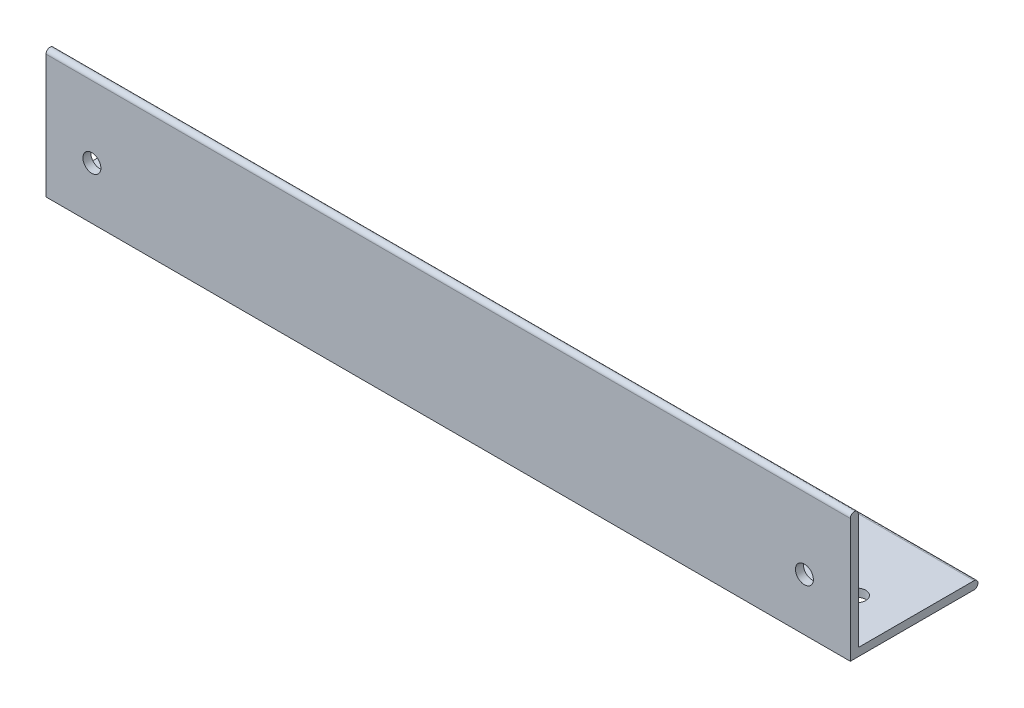
ISO-10303-21;
HEADER;
FILE_DESCRIPTION(('STEP AP214'),'2;1');
FILE_NAME('part.step','',(''),(''),'','','');
FILE_SCHEMA(('AUTOMOTIVE_DESIGN { 1 0 10303 214 1 1 1 1 }'));
ENDSEC;
DATA;
#1=APPLICATION_CONTEXT('core data for automotive mechanical design processes');
#2=APPLICATION_PROTOCOL_DEFINITION('international standard','automotive_design',2000,#1);
#3=PRODUCT_CONTEXT('',#1,'mechanical');
#4=PRODUCT('Part','Part','',(#3));
#5=PRODUCT_RELATED_PRODUCT_CATEGORY('part','',(#4));
#6=PRODUCT_DEFINITION_FORMATION('','',#4);
#7=PRODUCT_DEFINITION_CONTEXT('part definition',#1,'design');
#8=PRODUCT_DEFINITION('design','',#6,#7);
#9=PRODUCT_DEFINITION_SHAPE('','',#8);
#10=(LENGTH_UNIT() NAMED_UNIT(*) SI_UNIT(.MILLI.,.METRE.));
#11=(NAMED_UNIT(*) PLANE_ANGLE_UNIT() SI_UNIT($,.RADIAN.));
#12=(NAMED_UNIT(*) SI_UNIT($,.STERADIAN.) SOLID_ANGLE_UNIT());
#13=UNCERTAINTY_MEASURE_WITH_UNIT(LENGTH_MEASURE(1.E-05),#10,'distance_accuracy_value','');
#14=(GEOMETRIC_REPRESENTATION_CONTEXT(3) GLOBAL_UNCERTAINTY_ASSIGNED_CONTEXT((#13)) GLOBAL_UNIT_ASSIGNED_CONTEXT((#10,
#11,#12)) REPRESENTATION_CONTEXT('',''));
#15=CARTESIAN_POINT('',(0.,0.,0.));
#16=DIRECTION('',(0.,0.,1.));
#17=DIRECTION('',(1.,0.,0.));
#18=AXIS2_PLACEMENT_3D('',#15,#16,#17);
#19=CARTESIAN_POINT('',(160.,0.793749999999999,-24.60625));
#20=DIRECTION('',(-1.,0.,0.));
#21=DIRECTION('',(0.,0.,1.));
#22=AXIS2_PLACEMENT_3D('',#19,#20,#21);
#23=CYLINDRICAL_SURFACE('',#22,0.793749999999999);
#24=DIRECTION('',(-1.,0.,0.));
#25=VECTOR('',#24,1.);
#26=CARTESIAN_POINT('',(160.,1.5875,-24.60625));
#27=LINE('',#26,#25);
#28=CARTESIAN_POINT('',(160.,1.5875,-24.60625));
#29=VERTEX_POINT('',#28);
#30=CARTESIAN_POINT('',(0.,1.5875,-24.60625));
#31=VERTEX_POINT('',#30);
#32=EDGE_CURVE('E155',#29,#31,#27,.T.);
#33=ORIENTED_EDGE('',*,*,#32,.F.);
#34=CARTESIAN_POINT('',(160.,0.793749999999999,-24.60625));
#35=DIRECTION('',(-1.,0.,0.));
#36=DIRECTION('',(0.,0.,1.));
#37=AXIS2_PLACEMENT_3D('',#34,#35,#36);
#38=CIRCLE('',#37,0.793749999999999);
#39=CARTESIAN_POINT('',(160.,0.,-24.60625));
#40=VERTEX_POINT('',#39);
#41=EDGE_CURVE('E51',#40,#29,#38,.F.);
#42=ORIENTED_EDGE('',*,*,#41,.F.);
#43=DIRECTION('',(-1.,0.,0.));
#44=VECTOR('',#43,1.);
#45=CARTESIAN_POINT('',(160.,0.,-24.60625));
#46=LINE('',#45,#44);
#47=CARTESIAN_POINT('',(0.,0.,-24.60625));
#48=VERTEX_POINT('',#47);
#49=EDGE_CURVE('E158',#48,#40,#46,.F.);
#50=ORIENTED_EDGE('',*,*,#49,.F.);
#51=CARTESIAN_POINT('',(0.,0.793749999999999,-24.60625));
#52=DIRECTION('',(-1.,0.,0.));
#53=DIRECTION('',(0.,0.,1.));
#54=AXIS2_PLACEMENT_3D('',#51,#52,#53);
#55=CIRCLE('',#54,0.793749999999999);
#56=EDGE_CURVE('E11',#31,#48,#55,.T.);
#57=ORIENTED_EDGE('',*,*,#56,.F.);
#58=EDGE_LOOP('',(#33,#42,#50,#57));
#59=FACE_BOUND('',#58,.T.);
#60=ADVANCED_FACE('F41',(#59),#23,.T.);
#61=CARTESIAN_POINT('',(160.,24.60625,-0.79375));
#62=DIRECTION('',(-1.,0.,0.));
#63=DIRECTION('',(0.,0.,1.));
#64=AXIS2_PLACEMENT_3D('',#61,#62,#63);
#65=CYLINDRICAL_SURFACE('',#64,0.79375);
#66=DIRECTION('',(-1.,0.,0.));
#67=VECTOR('',#66,1.);
#68=CARTESIAN_POINT('',(160.,24.60625,0.));
#69=LINE('',#68,#67);
#70=CARTESIAN_POINT('',(160.,24.60625,0.));
#71=VERTEX_POINT('',#70);
#72=CARTESIAN_POINT('',(0.,24.60625,0.));
#73=VERTEX_POINT('',#72);
#74=EDGE_CURVE('E114',#71,#73,#69,.T.);
#75=ORIENTED_EDGE('',*,*,#74,.F.);
#76=CARTESIAN_POINT('',(160.,24.60625,-0.79375));
#77=DIRECTION('',(-1.,0.,0.));
#78=DIRECTION('',(0.,0.,1.));
#79=AXIS2_PLACEMENT_3D('',#76,#77,#78);
#80=CIRCLE('',#79,0.79375);
#81=CARTESIAN_POINT('',(160.,24.60625,-1.5875));
#82=VERTEX_POINT('',#81);
#83=EDGE_CURVE('E149',#82,#71,#80,.F.);
#84=ORIENTED_EDGE('',*,*,#83,.F.);
#85=DIRECTION('',(-1.,0.,0.));
#86=VECTOR('',#85,1.);
#87=CARTESIAN_POINT('',(160.,24.60625,-1.5875));
#88=LINE('',#87,#86);
#89=CARTESIAN_POINT('',(0.,24.60625,-1.5875));
#90=VERTEX_POINT('',#89);
#91=EDGE_CURVE('E120',#90,#82,#88,.F.);
#92=ORIENTED_EDGE('',*,*,#91,.F.);
#93=CARTESIAN_POINT('',(0.,24.60625,-0.79375));
#94=DIRECTION('',(-1.,0.,0.));
#95=DIRECTION('',(0.,0.,1.));
#96=AXIS2_PLACEMENT_3D('',#93,#94,#95);
#97=CIRCLE('',#96,0.79375);
#98=EDGE_CURVE('E152',#73,#90,#97,.T.);
#99=ORIENTED_EDGE('',*,*,#98,.F.);
#100=EDGE_LOOP('',(#75,#84,#92,#99));
#101=FACE_BOUND('',#100,.T.);
#102=ADVANCED_FACE('F220',(#101),#65,.T.);
#103=CARTESIAN_POINT('',(160.,0.,-25.4));
#104=DIRECTION('',(0.,1.,0.));
#105=DIRECTION('',(0.,0.,1.));
#106=AXIS2_PLACEMENT_3D('',#103,#104,#105);
#107=PLANE('',#106);
#108=CARTESIAN_POINT('',(55.,0.,-12.7));
#109=DIRECTION('',(0.,-1.,0.));
#110=DIRECTION('',(0.,0.,-1.));
#111=AXIS2_PLACEMENT_3D('',#108,#109,#110);
#112=CIRCLE('',#111,1.785);
#113=CARTESIAN_POINT('',(55.,0.,-14.485));
#114=VERTEX_POINT('',#113);
#115=EDGE_CURVE('E173',#114,#114,#112,.T.);
#116=ORIENTED_EDGE('',*,*,#115,.F.);
#117=EDGE_LOOP('',(#116));
#118=FACE_BOUND('',#117,.T.);
#119=CARTESIAN_POINT('',(105.,0.,-12.7));
#120=DIRECTION('',(0.,-1.,0.));
#121=DIRECTION('',(0.,0.,-1.));
#122=AXIS2_PLACEMENT_3D('',#119,#120,#121);
#123=CIRCLE('',#122,1.78499999999999);
#124=CARTESIAN_POINT('',(105.,0.,-14.485));
#125=VERTEX_POINT('',#124);
#126=EDGE_CURVE('E181',#125,#125,#123,.T.);
#127=ORIENTED_EDGE('',*,*,#126,.F.);
#128=EDGE_LOOP('',(#127));
#129=FACE_BOUND('',#128,.T.);
#130=CARTESIAN_POINT('',(9.13,0.,-10.41));
#131=DIRECTION('',(0.,-1.,0.));
#132=DIRECTION('',(0.,0.,1.));
#133=AXIS2_PLACEMENT_3D('',#130,#131,#132);
#134=CIRCLE('',#133,1.785);
#135=CARTESIAN_POINT('',(9.13,0.,-8.625));
#136=VERTEX_POINT('',#135);
#137=EDGE_CURVE('E167',#136,#136,#134,.T.);
#138=ORIENTED_EDGE('',*,*,#137,.F.);
#139=EDGE_LOOP('',(#138));
#140=FACE_BOUND('',#139,.T.);
#141=CARTESIAN_POINT('',(150.87,0.,-10.41));
#142=DIRECTION('',(0.,-1.,0.));
#143=DIRECTION('',(0.,0.,-1.));
#144=AXIS2_PLACEMENT_3D('',#141,#142,#143);
#145=CIRCLE('',#144,1.78500000000001);
#146=CARTESIAN_POINT('',(150.87,0.,-12.195));
#147=VERTEX_POINT('',#146);
#148=EDGE_CURVE('E201',#147,#147,#145,.T.);
#149=ORIENTED_EDGE('',*,*,#148,.F.);
#150=EDGE_LOOP('',(#149));
#151=FACE_BOUND('',#150,.T.);
#152=DIRECTION('',(0.,0.,-1.));
#153=VECTOR('',#152,1.);
#154=CARTESIAN_POINT('',(0.,0.,-25.4));
#155=LINE('',#154,#153);
#156=CARTESIAN_POINT('',(0.,0.,0.));
#157=VERTEX_POINT('',#156);
#158=EDGE_CURVE('E128',#157,#48,#155,.T.);
#159=ORIENTED_EDGE('',*,*,#158,.T.);
#160=ORIENTED_EDGE('',*,*,#49,.T.);
#161=DIRECTION('',(0.,0.,-1.));
#162=VECTOR('',#161,1.);
#163=CARTESIAN_POINT('',(160.,0.,-25.4));
#164=LINE('',#163,#162);
#165=CARTESIAN_POINT('',(160.,0.,0.));
#166=VERTEX_POINT('',#165);
#167=EDGE_CURVE('E104',#166,#40,#164,.T.);
#168=ORIENTED_EDGE('',*,*,#167,.F.);
#169=DIRECTION('',(-1.,0.,0.));
#170=VECTOR('',#169,1.);
#171=CARTESIAN_POINT('',(160.,0.,0.));
#172=LINE('',#171,#170);
#173=EDGE_CURVE('E115',#166,#157,#172,.T.);
#174=ORIENTED_EDGE('',*,*,#173,.T.);
#175=EDGE_LOOP('',(#159,#160,#168,#174));
#176=FACE_BOUND('',#175,.T.);
#177=ADVANCED_FACE('F215',(#118,#129,#140,#151,#176),#107,.F.);
#178=CARTESIAN_POINT('',(160.,1.5875,-1.5875));
#179=DIRECTION('',(0.,-1.,0.));
#180=DIRECTION('',(0.,0.,-1.));
#181=AXIS2_PLACEMENT_3D('',#178,#179,#180);
#182=PLANE('',#181);
#183=CARTESIAN_POINT('',(55.,1.5875,-12.7));
#184=DIRECTION('',(0.,-1.,0.));
#185=DIRECTION('',(0.,0.,-1.));
#186=AXIS2_PLACEMENT_3D('',#183,#184,#185);
#187=CIRCLE('',#186,1.785);
#188=CARTESIAN_POINT('',(55.,1.5875,-14.485));
#189=VERTEX_POINT('',#188);
#190=EDGE_CURVE('E45',#189,#189,#187,.T.);
#191=ORIENTED_EDGE('',*,*,#190,.T.);
#192=EDGE_LOOP('',(#191));
#193=FACE_BOUND('',#192,.T.);
#194=CARTESIAN_POINT('',(105.,1.5875,-12.7));
#195=DIRECTION('',(0.,-1.,0.));
#196=DIRECTION('',(0.,0.,-1.));
#197=AXIS2_PLACEMENT_3D('',#194,#195,#196);
#198=CIRCLE('',#197,1.78499999999999);
#199=CARTESIAN_POINT('',(105.,1.5875,-14.485));
#200=VERTEX_POINT('',#199);
#201=EDGE_CURVE('E170',#200,#200,#198,.T.);
#202=ORIENTED_EDGE('',*,*,#201,.T.);
#203=EDGE_LOOP('',(#202));
#204=FACE_BOUND('',#203,.T.);
#205=CARTESIAN_POINT('',(9.13,1.5875,-10.41));
#206=DIRECTION('',(0.,-1.,0.));
#207=DIRECTION('',(0.,0.,-1.));
#208=AXIS2_PLACEMENT_3D('',#205,#206,#207);
#209=CIRCLE('',#208,1.785);
#210=CARTESIAN_POINT('',(9.13,1.5875,-12.195));
#211=VERTEX_POINT('',#210);
#212=EDGE_CURVE('E132',#211,#211,#209,.T.);
#213=ORIENTED_EDGE('',*,*,#212,.T.);
#214=EDGE_LOOP('',(#213));
#215=FACE_BOUND('',#214,.T.);
#216=CARTESIAN_POINT('',(150.87,1.5875,-10.41));
#217=DIRECTION('',(0.,-1.,0.));
#218=DIRECTION('',(0.,0.,-1.));
#219=AXIS2_PLACEMENT_3D('',#216,#217,#218);
#220=CIRCLE('',#219,1.78500000000001);
#221=CARTESIAN_POINT('',(150.87,1.5875,-12.195));
#222=VERTEX_POINT('',#221);
#223=EDGE_CURVE('E163',#222,#222,#220,.T.);
#224=ORIENTED_EDGE('',*,*,#223,.T.);
#225=EDGE_LOOP('',(#224));
#226=FACE_BOUND('',#225,.T.);
#227=DIRECTION('',(0.,0.,1.));
#228=VECTOR('',#227,1.);
#229=CARTESIAN_POINT('',(160.,1.5875,-1.5875));
#230=LINE('',#229,#228);
#231=CARTESIAN_POINT('',(160.,1.5875,-1.5875));
#232=VERTEX_POINT('',#231);
#233=EDGE_CURVE('E95',#29,#232,#230,.T.);
#234=ORIENTED_EDGE('',*,*,#233,.F.);
#235=ORIENTED_EDGE('',*,*,#32,.T.);
#236=DIRECTION('',(0.,0.,1.));
#237=VECTOR('',#236,1.);
#238=CARTESIAN_POINT('',(0.,1.5875,-1.5875));
#239=LINE('',#238,#237);
#240=CARTESIAN_POINT('',(0.,1.5875,-1.5875));
#241=VERTEX_POINT('',#240);
#242=EDGE_CURVE('E109',#31,#241,#239,.T.);
#243=ORIENTED_EDGE('',*,*,#242,.T.);
#244=DIRECTION('',(-1.,0.,0.));
#245=VECTOR('',#244,1.);
#246=CARTESIAN_POINT('',(160.,1.5875,-1.5875));
#247=LINE('',#246,#245);
#248=EDGE_CURVE('E107',#232,#241,#247,.T.);
#249=ORIENTED_EDGE('',*,*,#248,.F.);
#250=EDGE_LOOP('',(#234,#235,#243,#249));
#251=FACE_BOUND('',#250,.T.);
#252=ADVANCED_FACE('F108',(#193,#204,#215,#226,#251),#182,.F.);
#253=CARTESIAN_POINT('',(160.,25.4,-1.5875));
#254=DIRECTION('',(0.,0.,1.));
#255=DIRECTION('',(0.,-1.,0.));
#256=AXIS2_PLACEMENT_3D('',#253,#254,#255);
#257=PLANE('',#256);
#258=CARTESIAN_POINT('',(9.13,10.41,-1.5875));
#259=DIRECTION('',(0.,0.,1.));
#260=DIRECTION('',(0.,1.,0.));
#261=AXIS2_PLACEMENT_3D('',#258,#259,#260);
#262=CIRCLE('',#261,1.78500000000001);
#263=CARTESIAN_POINT('',(9.13,12.195,-1.5875));
#264=VERTEX_POINT('',#263);
#265=EDGE_CURVE('E179',#264,#264,#262,.T.);
#266=ORIENTED_EDGE('',*,*,#265,.T.);
#267=EDGE_LOOP('',(#266));
#268=FACE_BOUND('',#267,.T.);
#269=CARTESIAN_POINT('',(150.87,10.41,-1.5875));
#270=DIRECTION('',(0.,0.,-1.));
#271=DIRECTION('',(0.,1.,0.));
#272=AXIS2_PLACEMENT_3D('',#269,#270,#271);
#273=CIRCLE('',#272,1.78500000000001);
#274=CARTESIAN_POINT('',(150.87,12.195,-1.5875));
#275=VERTEX_POINT('',#274);
#276=EDGE_CURVE('E193',#275,#275,#273,.T.);
#277=ORIENTED_EDGE('',*,*,#276,.F.);
#278=EDGE_LOOP('',(#277));
#279=FACE_BOUND('',#278,.T.);
#280=DIRECTION('',(0.,1.,0.));
#281=VECTOR('',#280,1.);
#282=CARTESIAN_POINT('',(0.,25.4,-1.5875));
#283=LINE('',#282,#281);
#284=EDGE_CURVE('E135',#241,#90,#283,.T.);
#285=ORIENTED_EDGE('',*,*,#284,.T.);
#286=ORIENTED_EDGE('',*,*,#91,.T.);
#287=DIRECTION('',(0.,1.,0.));
#288=VECTOR('',#287,1.);
#289=CARTESIAN_POINT('',(160.,25.4,-1.5875));
#290=LINE('',#289,#288);
#291=EDGE_CURVE('E100',#232,#82,#290,.T.);
#292=ORIENTED_EDGE('',*,*,#291,.F.);
#293=ORIENTED_EDGE('',*,*,#248,.T.);
#294=EDGE_LOOP('',(#285,#286,#292,#293));
#295=FACE_BOUND('',#294,.T.);
#296=ADVANCED_FACE('F118',(#268,#279,#295),#257,.F.);
#297=CARTESIAN_POINT('',(160.,0.,0.));
#298=DIRECTION('',(0.,0.,-1.));
#299=DIRECTION('',(-1.,0.,0.));
#300=AXIS2_PLACEMENT_3D('',#297,#298,#299);
#301=PLANE('',#300);
#302=CARTESIAN_POINT('',(9.13,10.41,0.));
#303=DIRECTION('',(0.,0.,1.));
#304=DIRECTION('',(0.,1.,0.));
#305=AXIS2_PLACEMENT_3D('',#302,#303,#304);
#306=CIRCLE('',#305,1.78500000000001);
#307=CARTESIAN_POINT('',(9.13,12.195,0.));
#308=VERTEX_POINT('',#307);
#309=EDGE_CURVE('E189',#308,#308,#306,.T.);
#310=ORIENTED_EDGE('',*,*,#309,.F.);
#311=EDGE_LOOP('',(#310));
#312=FACE_BOUND('',#311,.T.);
#313=CARTESIAN_POINT('',(150.87,10.41,0.));
#314=DIRECTION('',(0.,0.,-1.));
#315=DIRECTION('',(0.,1.,0.));
#316=AXIS2_PLACEMENT_3D('',#313,#314,#315);
#317=CIRCLE('',#316,1.78500000000001);
#318=CARTESIAN_POINT('',(150.87,12.195,0.));
#319=VERTEX_POINT('',#318);
#320=EDGE_CURVE('E197',#319,#319,#317,.T.);
#321=ORIENTED_EDGE('',*,*,#320,.T.);
#322=EDGE_LOOP('',(#321));
#323=FACE_BOUND('',#322,.T.);
#324=DIRECTION('',(0.,-1.,0.));
#325=VECTOR('',#324,1.);
#326=CARTESIAN_POINT('',(160.,0.,0.));
#327=LINE('',#326,#325);
#328=EDGE_CURVE('E122',#71,#166,#327,.T.);
#329=ORIENTED_EDGE('',*,*,#328,.F.);
#330=ORIENTED_EDGE('',*,*,#74,.T.);
#331=DIRECTION('',(0.,-1.,0.));
#332=VECTOR('',#331,1.);
#333=CARTESIAN_POINT('',(0.,0.,0.));
#334=LINE('',#333,#332);
#335=EDGE_CURVE('E138',#73,#157,#334,.T.);
#336=ORIENTED_EDGE('',*,*,#335,.T.);
#337=ORIENTED_EDGE('',*,*,#173,.F.);
#338=EDGE_LOOP('',(#329,#330,#336,#337));
#339=FACE_BOUND('',#338,.T.);
#340=ADVANCED_FACE('F222',(#312,#323,#339),#301,.F.);
#341=CARTESIAN_POINT('',(160.,0.,0.));
#342=DIRECTION('',(-1.,0.,0.));
#343=DIRECTION('',(0.,0.,1.));
#344=AXIS2_PLACEMENT_3D('',#341,#342,#343);
#345=PLANE('',#344);
#346=ORIENTED_EDGE('',*,*,#167,.T.);
#347=ORIENTED_EDGE('',*,*,#41,.T.);
#348=ORIENTED_EDGE('',*,*,#233,.T.);
#349=ORIENTED_EDGE('',*,*,#291,.T.);
#350=ORIENTED_EDGE('',*,*,#83,.T.);
#351=ORIENTED_EDGE('',*,*,#328,.T.);
#352=EDGE_LOOP('',(#346,#347,#348,#349,#350,#351));
#353=FACE_BOUND('',#352,.T.);
#354=ADVANCED_FACE('F98',(#353),#345,.F.);
#355=CARTESIAN_POINT('',(0.,0.,0.));
#356=DIRECTION('',(-1.,0.,0.));
#357=DIRECTION('',(0.,0.,1.));
#358=AXIS2_PLACEMENT_3D('',#355,#356,#357);
#359=PLANE('',#358);
#360=ORIENTED_EDGE('',*,*,#242,.F.);
#361=ORIENTED_EDGE('',*,*,#56,.T.);
#362=ORIENTED_EDGE('',*,*,#158,.F.);
#363=ORIENTED_EDGE('',*,*,#335,.F.);
#364=ORIENTED_EDGE('',*,*,#98,.T.);
#365=ORIENTED_EDGE('',*,*,#284,.F.);
#366=EDGE_LOOP('',(#360,#361,#362,#363,#364,#365));
#367=FACE_BOUND('',#366,.T.);
#368=ADVANCED_FACE('F216',(#367),#359,.T.);
#369=CARTESIAN_POINT('',(150.87,25.4,-10.41));
#370=DIRECTION('',(0.,-1.,0.));
#371=DIRECTION('',(0.,0.,-1.));
#372=AXIS2_PLACEMENT_3D('',#369,#370,#371);
#373=CYLINDRICAL_SURFACE('',#372,1.78500000000001);
#374=ORIENTED_EDGE('',*,*,#148,.T.);
#375=EDGE_LOOP('',(#374));
#376=FACE_BOUND('',#375,.T.);
#377=ORIENTED_EDGE('',*,*,#223,.F.);
#378=EDGE_LOOP('',(#377));
#379=FACE_BOUND('',#378,.T.);
#380=ADVANCED_FACE('F259',(#376,#379),#373,.F.);
#381=CARTESIAN_POINT('',(9.13,25.4,-10.41));
#382=DIRECTION('',(0.,-1.,0.));
#383=DIRECTION('',(0.,0.,-1.));
#384=AXIS2_PLACEMENT_3D('',#381,#382,#383);
#385=CYLINDRICAL_SURFACE('',#384,1.785);
#386=ORIENTED_EDGE('',*,*,#137,.T.);
#387=EDGE_LOOP('',(#386));
#388=FACE_BOUND('',#387,.T.);
#389=ORIENTED_EDGE('',*,*,#212,.F.);
#390=EDGE_LOOP('',(#389));
#391=FACE_BOUND('',#390,.T.);
#392=ADVANCED_FACE('F261',(#388,#391),#385,.F.);
#393=CARTESIAN_POINT('',(150.87,10.41,0.));
#394=DIRECTION('',(0.,0.,-1.));
#395=DIRECTION('',(0.,1.,0.));
#396=AXIS2_PLACEMENT_3D('',#393,#394,#395);
#397=CYLINDRICAL_SURFACE('',#396,1.78500000000001);
#398=ORIENTED_EDGE('',*,*,#320,.F.);
#399=EDGE_LOOP('',(#398));
#400=FACE_BOUND('',#399,.T.);
#401=ORIENTED_EDGE('',*,*,#276,.T.);
#402=EDGE_LOOP('',(#401));
#403=FACE_BOUND('',#402,.T.);
#404=ADVANCED_FACE('F268',(#400,#403),#397,.F.);
#405=CARTESIAN_POINT('',(9.13,10.41,0.));
#406=DIRECTION('',(0.,0.,-1.));
#407=DIRECTION('',(0.,1.,0.));
#408=AXIS2_PLACEMENT_3D('',#405,#406,#407);
#409=CYLINDRICAL_SURFACE('',#408,1.78500000000001);
#410=ORIENTED_EDGE('',*,*,#309,.T.);
#411=EDGE_LOOP('',(#410));
#412=FACE_BOUND('',#411,.T.);
#413=ORIENTED_EDGE('',*,*,#265,.F.);
#414=EDGE_LOOP('',(#413));
#415=FACE_BOUND('',#414,.T.);
#416=ADVANCED_FACE('F274',(#412,#415),#409,.F.);
#417=CARTESIAN_POINT('',(105.,10.,-12.7));
#418=DIRECTION('',(0.,-1.,0.));
#419=DIRECTION('',(0.,0.,-1.));
#420=AXIS2_PLACEMENT_3D('',#417,#418,#419);
#421=CYLINDRICAL_SURFACE('',#420,1.78499999999999);
#422=ORIENTED_EDGE('',*,*,#126,.T.);
#423=EDGE_LOOP('',(#422));
#424=FACE_BOUND('',#423,.T.);
#425=ORIENTED_EDGE('',*,*,#201,.F.);
#426=EDGE_LOOP('',(#425));
#427=FACE_BOUND('',#426,.T.);
#428=ADVANCED_FACE('F278',(#424,#427),#421,.F.);
#429=CARTESIAN_POINT('',(55.,10.,-12.7));
#430=DIRECTION('',(0.,-1.,0.));
#431=DIRECTION('',(0.,0.,-1.));
#432=AXIS2_PLACEMENT_3D('',#429,#430,#431);
#433=CYLINDRICAL_SURFACE('',#432,1.785);
#434=ORIENTED_EDGE('',*,*,#115,.T.);
#435=EDGE_LOOP('',(#434));
#436=FACE_BOUND('',#435,.T.);
#437=ORIENTED_EDGE('',*,*,#190,.F.);
#438=EDGE_LOOP('',(#437));
#439=FACE_BOUND('',#438,.T.);
#440=ADVANCED_FACE('F282',(#436,#439),#433,.F.);
#441=CLOSED_SHELL('',(#60,#102,#177,#252,#296,#340,#354,#368,#380,#392,#404,#416,#428,#440));
#442=MANIFOLD_SOLID_BREP('B2',#441);
#443=ADVANCED_BREP_SHAPE_REPRESENTATION('',(#18,#442),#14);
#444=SHAPE_DEFINITION_REPRESENTATION(#9,#443);
ENDSEC;
END-ISO-10303-21;
